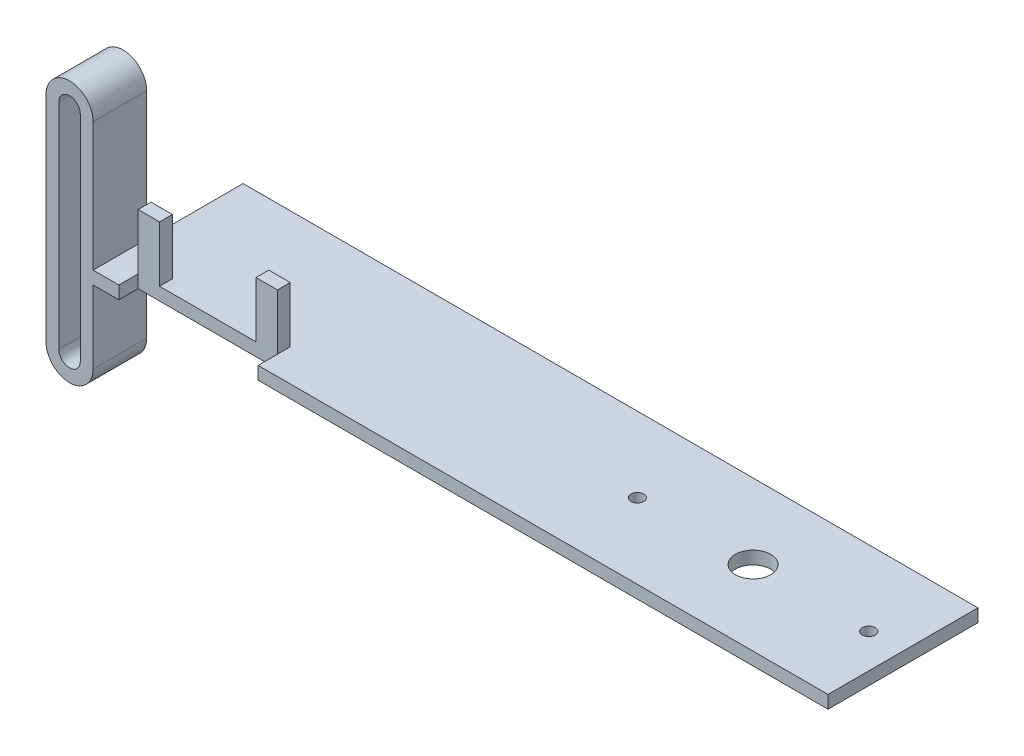
ISO-10303-21;
HEADER;
FILE_DESCRIPTION(('STEP AP214'),'2;1');
FILE_NAME('part.step','',(''),(''),'','','');
FILE_SCHEMA(('AUTOMOTIVE_DESIGN { 1 0 10303 214 1 1 1 1 }'));
ENDSEC;
DATA;
#1=APPLICATION_CONTEXT('core data for automotive mechanical design processes');
#2=APPLICATION_PROTOCOL_DEFINITION('international standard','automotive_design',2000,#1);
#3=PRODUCT_CONTEXT('',#1,'mechanical');
#4=PRODUCT('Part','Part','',(#3));
#5=PRODUCT_RELATED_PRODUCT_CATEGORY('part','',(#4));
#6=PRODUCT_DEFINITION_FORMATION('','',#4);
#7=PRODUCT_DEFINITION_CONTEXT('part definition',#1,'design');
#8=PRODUCT_DEFINITION('design','',#6,#7);
#9=PRODUCT_DEFINITION_SHAPE('','',#8);
#10=(LENGTH_UNIT() NAMED_UNIT(*) SI_UNIT(.MILLI.,.METRE.));
#11=(NAMED_UNIT(*) PLANE_ANGLE_UNIT() SI_UNIT($,.RADIAN.));
#12=(NAMED_UNIT(*) SI_UNIT($,.STERADIAN.) SOLID_ANGLE_UNIT());
#13=UNCERTAINTY_MEASURE_WITH_UNIT(LENGTH_MEASURE(1.E-05),#10,'distance_accuracy_value','');
#14=(GEOMETRIC_REPRESENTATION_CONTEXT(3) GLOBAL_UNCERTAINTY_ASSIGNED_CONTEXT((#13)) GLOBAL_UNIT_ASSIGNED_CONTEXT((#10,
#11,#12)) REPRESENTATION_CONTEXT('',''));
#15=CARTESIAN_POINT('',(0.,0.,0.));
#16=DIRECTION('',(0.,0.,1.));
#17=DIRECTION('',(1.,0.,0.));
#18=AXIS2_PLACEMENT_3D('',#15,#16,#17);
#19=CARTESIAN_POINT('',(0.,3.,0.));
#20=DIRECTION('',(0.,1.,0.));
#21=DIRECTION('',(0.,0.,1.));
#22=AXIS2_PLACEMENT_3D('',#19,#20,#21);
#23=PLANE('',#22);
#24=DIRECTION('',(0.,0.,1.));
#25=VECTOR('',#24,1.);
#26=CARTESIAN_POINT('',(-50.5000000000004,3.,5.));
#27=LINE('',#26,#25);
#28=CARTESIAN_POINT('',(-50.5000000000004,3.,5.));
#29=VERTEX_POINT('',#28);
#30=CARTESIAN_POINT('',(-50.5000000000004,3.,8.));
#31=VERTEX_POINT('',#30);
#32=EDGE_CURVE('E226',#29,#31,#27,.T.);
#33=ORIENTED_EDGE('',*,*,#32,.T.);
#34=DIRECTION('',(0.,0.,-1.));
#35=VECTOR('',#34,1.);
#36=CARTESIAN_POINT('',(-50.5000000000004,3.,0.));
#37=LINE('',#36,#35);
#38=CARTESIAN_POINT('',(-50.5000000000004,3.,12.5));
#39=VERTEX_POINT('',#38);
#40=EDGE_CURVE('E302',#39,#31,#37,.T.);
#41=ORIENTED_EDGE('',*,*,#40,.F.);
#42=DIRECTION('',(1.,0.,0.));
#43=VECTOR('',#42,1.);
#44=CARTESIAN_POINT('',(0.,3.,12.5));
#45=LINE('',#44,#43);
#46=CARTESIAN_POINT('',(82.5,3.,12.5));
#47=VERTEX_POINT('',#46);
#48=EDGE_CURVE('E426',#39,#47,#45,.T.);
#49=ORIENTED_EDGE('',*,*,#48,.T.);
#50=DIRECTION('',(0.,0.,1.));
#51=VECTOR('',#50,1.);
#52=CARTESIAN_POINT('',(82.5,3.,0.));
#53=LINE('',#52,#51);
#54=CARTESIAN_POINT('',(82.5,3.,-22.5));
#55=VERTEX_POINT('',#54);
#56=EDGE_CURVE('E425',#55,#47,#53,.T.);
#57=ORIENTED_EDGE('',*,*,#56,.F.);
#58=DIRECTION('',(1.,0.,0.));
#59=VECTOR('',#58,1.);
#60=CARTESIAN_POINT('',(0.,3.,-22.5));
#61=LINE('',#60,#59);
#62=CARTESIAN_POINT('',(-89.0000000000003,3.,-22.5));
#63=VERTEX_POINT('',#62);
#64=EDGE_CURVE('E430',#63,#55,#61,.T.);
#65=ORIENTED_EDGE('',*,*,#64,.F.);
#66=DIRECTION('',(0.,0.,1.));
#67=VECTOR('',#66,1.);
#68=CARTESIAN_POINT('',(-89.0000000000003,3.,0.));
#69=LINE('',#68,#67);
#70=CARTESIAN_POINT('',(-89.0000000000003,3.,0.));
#71=VERTEX_POINT('',#70);
#72=EDGE_CURVE('E326',#63,#71,#69,.T.);
#73=ORIENTED_EDGE('',*,*,#72,.T.);
#74=DIRECTION('',(0.,0.,-1.));
#75=VECTOR('',#74,1.);
#76=CARTESIAN_POINT('',(-89.0000000000003,3.,0.));
#77=LINE('',#76,#75);
#78=CARTESIAN_POINT('',(-89.0000000000003,3.,12.5));
#79=VERTEX_POINT('',#78);
#80=EDGE_CURVE('E353',#79,#71,#77,.T.);
#81=ORIENTED_EDGE('',*,*,#80,.F.);
#82=CARTESIAN_POINT('',(-83.0000000000004,3.,12.5));
#83=VERTEX_POINT('',#82);
#84=EDGE_CURVE('E421',#79,#83,#45,.T.);
#85=ORIENTED_EDGE('',*,*,#84,.T.);
#86=DIRECTION('',(0.,0.,-1.));
#87=VECTOR('',#86,1.);
#88=CARTESIAN_POINT('',(-83.0000000000004,3.,0.));
#89=LINE('',#88,#87);
#90=CARTESIAN_POINT('',(-83.0000000000004,3.,8.));
#91=VERTEX_POINT('',#90);
#92=EDGE_CURVE('E309',#83,#91,#89,.T.);
#93=ORIENTED_EDGE('',*,*,#92,.T.);
#94=DIRECTION('',(0.,0.,1.));
#95=VECTOR('',#94,1.);
#96=CARTESIAN_POINT('',(-83.0000000000004,3.,5.));
#97=LINE('',#96,#95);
#98=CARTESIAN_POINT('',(-83.0000000000004,3.,5.));
#99=VERTEX_POINT('',#98);
#100=EDGE_CURVE('E266',#99,#91,#97,.T.);
#101=ORIENTED_EDGE('',*,*,#100,.F.);
#102=DIRECTION('',(1.,0.,0.));
#103=VECTOR('',#102,1.);
#104=CARTESIAN_POINT('',(-83.0000000000004,3.,5.));
#105=LINE('',#104,#103);
#106=CARTESIAN_POINT('',(-78.0000000000004,3.,5.));
#107=VERTEX_POINT('',#106);
#108=EDGE_CURVE('E254',#99,#107,#105,.T.);
#109=ORIENTED_EDGE('',*,*,#108,.T.);
#110=DIRECTION('',(0.,0.,1.));
#111=VECTOR('',#110,1.);
#112=CARTESIAN_POINT('',(-78.0000000000004,3.,5.));
#113=LINE('',#112,#111);
#114=CARTESIAN_POINT('',(-78.0000000000004,3.,8.));
#115=VERTEX_POINT('',#114);
#116=EDGE_CURVE('E284',#107,#115,#113,.T.);
#117=ORIENTED_EDGE('',*,*,#116,.T.);
#118=DIRECTION('',(1.,0.,0.));
#119=VECTOR('',#118,1.);
#120=CARTESIAN_POINT('',(0.,3.,8.));
#121=LINE('',#120,#119);
#122=CARTESIAN_POINT('',(-55.5000000000004,3.,8.));
#123=VERTEX_POINT('',#122);
#124=EDGE_CURVE('E313',#115,#123,#121,.T.);
#125=ORIENTED_EDGE('',*,*,#124,.T.);
#126=DIRECTION('',(0.,0.,1.));
#127=VECTOR('',#126,1.);
#128=CARTESIAN_POINT('',(-55.5000000000004,3.,5.));
#129=LINE('',#128,#127);
#130=CARTESIAN_POINT('',(-55.5000000000004,3.,5.));
#131=VERTEX_POINT('',#130);
#132=EDGE_CURVE('E64',#131,#123,#129,.T.);
#133=ORIENTED_EDGE('',*,*,#132,.F.);
#134=DIRECTION('',(1.,0.,0.));
#135=VECTOR('',#134,1.);
#136=CARTESIAN_POINT('',(-50.5000000000004,3.,5.));
#137=LINE('',#136,#135);
#138=EDGE_CURVE('E59',#131,#29,#137,.T.);
#139=ORIENTED_EDGE('',*,*,#138,.T.);
#140=EDGE_LOOP('',(#33,#41,#49,#57,#65,#73,#81,#85,#93,#101,#109,#117,#125,#133,#139));
#141=FACE_BOUND('',#140,.T.);
#142=CARTESIAN_POINT('',(47.5,3.,-5.));
#143=DIRECTION('',(0.,1.,0.));
#144=DIRECTION('',(0.,0.,1.));
#145=AXIS2_PLACEMENT_3D('',#142,#143,#144);
#146=CIRCLE('',#145,4.125);
#147=CARTESIAN_POINT('',(47.5,3.,-0.875000000000003));
#148=VERTEX_POINT('',#147);
#149=EDGE_CURVE('E433',#148,#148,#146,.T.);
#150=ORIENTED_EDGE('',*,*,#149,.F.);
#151=EDGE_LOOP('',(#150));
#152=FACE_BOUND('',#151,.T.);
#153=CARTESIAN_POINT('',(74.5,3.,-5.));
#154=DIRECTION('',(0.,1.,0.));
#155=DIRECTION('',(0.,0.,1.));
#156=AXIS2_PLACEMENT_3D('',#153,#154,#155);
#157=CIRCLE('',#156,1.5);
#158=CARTESIAN_POINT('',(74.5,3.,-3.5));
#159=VERTEX_POINT('',#158);
#160=EDGE_CURVE('E437',#159,#159,#157,.T.);
#161=ORIENTED_EDGE('',*,*,#160,.F.);
#162=EDGE_LOOP('',(#161));
#163=FACE_BOUND('',#162,.T.);
#164=CARTESIAN_POINT('',(20.5,3.,-4.99999999999999));
#165=DIRECTION('',(0.,1.,0.));
#166=DIRECTION('',(0.,0.,1.));
#167=AXIS2_PLACEMENT_3D('',#164,#165,#166);
#168=CIRCLE('',#167,1.5);
#169=CARTESIAN_POINT('',(20.5,3.,-3.49999999999999));
#170=VERTEX_POINT('',#169);
#171=EDGE_CURVE('E441',#170,#170,#168,.F.);
#172=ORIENTED_EDGE('',*,*,#171,.T.);
#173=EDGE_LOOP('',(#172));
#174=FACE_BOUND('',#173,.T.);
#175=ADVANCED_FACE('F43',(#141,#152,#163,#174),#23,.T.);
#176=CARTESIAN_POINT('',(0.,0.,0.));
#177=DIRECTION('',(0.,1.,0.));
#178=DIRECTION('',(0.,0.,1.));
#179=AXIS2_PLACEMENT_3D('',#176,#177,#178);
#180=PLANE('',#179);
#181=CARTESIAN_POINT('',(47.5,0.,-5.));
#182=DIRECTION('',(0.,1.,0.));
#183=DIRECTION('',(0.,0.,1.));
#184=AXIS2_PLACEMENT_3D('',#181,#182,#183);
#185=CIRCLE('',#184,4.125);
#186=CARTESIAN_POINT('',(47.5,0.,-0.875000000000003));
#187=VERTEX_POINT('',#186);
#188=EDGE_CURVE('E457',#187,#187,#185,.T.);
#189=ORIENTED_EDGE('',*,*,#188,.T.);
#190=EDGE_LOOP('',(#189));
#191=FACE_BOUND('',#190,.T.);
#192=CARTESIAN_POINT('',(74.5,0.,-5.));
#193=DIRECTION('',(0.,1.,0.));
#194=DIRECTION('',(0.,0.,1.));
#195=AXIS2_PLACEMENT_3D('',#192,#193,#194);
#196=CIRCLE('',#195,1.5);
#197=CARTESIAN_POINT('',(74.5,0.,-3.5));
#198=VERTEX_POINT('',#197);
#199=EDGE_CURVE('E461',#198,#198,#196,.T.);
#200=ORIENTED_EDGE('',*,*,#199,.T.);
#201=EDGE_LOOP('',(#200));
#202=FACE_BOUND('',#201,.T.);
#203=CARTESIAN_POINT('',(20.5,0.,-4.99999999999999));
#204=DIRECTION('',(0.,1.,0.));
#205=DIRECTION('',(0.,0.,1.));
#206=AXIS2_PLACEMENT_3D('',#203,#204,#205);
#207=CIRCLE('',#206,1.5);
#208=CARTESIAN_POINT('',(20.5,0.,-3.49999999999999));
#209=VERTEX_POINT('',#208);
#210=EDGE_CURVE('E465',#209,#209,#207,.F.);
#211=ORIENTED_EDGE('',*,*,#210,.F.);
#212=EDGE_LOOP('',(#211));
#213=FACE_BOUND('',#212,.T.);
#214=DIRECTION('',(0.,0.,-1.));
#215=VECTOR('',#214,1.);
#216=CARTESIAN_POINT('',(-83.0000000000004,0.,0.));
#217=LINE('',#216,#215);
#218=CARTESIAN_POINT('',(-83.0000000000004,0.,12.5));
#219=VERTEX_POINT('',#218);
#220=CARTESIAN_POINT('',(-83.0000000000004,0.,8.));
#221=VERTEX_POINT('',#220);
#222=EDGE_CURVE('E306',#219,#221,#217,.T.);
#223=ORIENTED_EDGE('',*,*,#222,.F.);
#224=DIRECTION('',(1.,0.,0.));
#225=VECTOR('',#224,1.);
#226=CARTESIAN_POINT('',(0.,0.,12.5));
#227=LINE('',#226,#225);
#228=CARTESIAN_POINT('',(-89.0000000000002,0.,12.5));
#229=VERTEX_POINT('',#228);
#230=EDGE_CURVE('E446',#229,#219,#227,.T.);
#231=ORIENTED_EDGE('',*,*,#230,.F.);
#232=DIRECTION('',(0.,0.,-1.));
#233=VECTOR('',#232,1.);
#234=CARTESIAN_POINT('',(-89.0000000000003,0.,0.));
#235=LINE('',#234,#233);
#236=CARTESIAN_POINT('',(-89.0000000000003,0.,0.));
#237=VERTEX_POINT('',#236);
#238=EDGE_CURVE('E479',#229,#237,#235,.T.);
#239=ORIENTED_EDGE('',*,*,#238,.T.);
#240=DIRECTION('',(0.,0.,1.));
#241=VECTOR('',#240,1.);
#242=CARTESIAN_POINT('',(-89.0000000000003,0.,0.));
#243=LINE('',#242,#241);
#244=CARTESIAN_POINT('',(-89.0000000000003,0.,-22.5));
#245=VERTEX_POINT('',#244);
#246=EDGE_CURVE('E323',#245,#237,#243,.T.);
#247=ORIENTED_EDGE('',*,*,#246,.F.);
#248=DIRECTION('',(1.,0.,0.));
#249=VECTOR('',#248,1.);
#250=CARTESIAN_POINT('',(0.,0.,-22.5));
#251=LINE('',#250,#249);
#252=CARTESIAN_POINT('',(82.5,0.,-22.5));
#253=VERTEX_POINT('',#252);
#254=EDGE_CURVE('E454',#245,#253,#251,.T.);
#255=ORIENTED_EDGE('',*,*,#254,.T.);
#256=DIRECTION('',(0.,0.,1.));
#257=VECTOR('',#256,1.);
#258=CARTESIAN_POINT('',(82.5,0.,0.));
#259=LINE('',#258,#257);
#260=CARTESIAN_POINT('',(82.5,0.,12.5));
#261=VERTEX_POINT('',#260);
#262=EDGE_CURVE('E450',#253,#261,#259,.T.);
#263=ORIENTED_EDGE('',*,*,#262,.T.);
#264=CARTESIAN_POINT('',(-50.5000000000004,0.,12.5));
#265=VERTEX_POINT('',#264);
#266=EDGE_CURVE('E420',#265,#261,#227,.T.);
#267=ORIENTED_EDGE('',*,*,#266,.F.);
#268=DIRECTION('',(0.,0.,-1.));
#269=VECTOR('',#268,1.);
#270=CARTESIAN_POINT('',(-50.5000000000004,0.,0.));
#271=LINE('',#270,#269);
#272=CARTESIAN_POINT('',(-50.5000000000004,0.,8.));
#273=VERTEX_POINT('',#272);
#274=EDGE_CURVE('E298',#265,#273,#271,.T.);
#275=ORIENTED_EDGE('',*,*,#274,.T.);
#276=DIRECTION('',(1.,0.,0.));
#277=VECTOR('',#276,1.);
#278=CARTESIAN_POINT('',(0.,0.,8.));
#279=LINE('',#278,#277);
#280=EDGE_CURVE('E11',#221,#273,#279,.T.);
#281=ORIENTED_EDGE('',*,*,#280,.F.);
#282=EDGE_LOOP('',(#223,#231,#239,#247,#255,#263,#267,#275,#281));
#283=FACE_BOUND('',#282,.T.);
#284=ADVANCED_FACE('F495',(#191,#202,#213,#283),#180,.F.);
#285=CARTESIAN_POINT('',(0.,3.,12.5));
#286=DIRECTION('',(0.,0.,-1.));
#287=DIRECTION('',(-1.,0.,0.));
#288=AXIS2_PLACEMENT_3D('',#285,#286,#287);
#289=PLANE('',#288);
#290=DIRECTION('',(0.,1.,0.));
#291=VECTOR('',#290,1.);
#292=CARTESIAN_POINT('',(-97.,0.,12.5));
#293=LINE('',#292,#291);
#294=CARTESIAN_POINT('',(-97.,-17.0000000000001,12.5));
#295=VERTEX_POINT('',#294);
#296=CARTESIAN_POINT('',(-97.,33.0000000000001,12.5));
#297=VERTEX_POINT('',#296);
#298=EDGE_CURVE('E347',#295,#297,#293,.T.);
#299=ORIENTED_EDGE('',*,*,#298,.T.);
#300=CARTESIAN_POINT('',(-94.5000000000001,33.0000000000001,12.5));
#301=DIRECTION('',(0.,0.,-1.));
#302=DIRECTION('',(-1.,0.,0.));
#303=AXIS2_PLACEMENT_3D('',#300,#301,#302);
#304=CIRCLE('',#303,2.49999999999984);
#305=CARTESIAN_POINT('',(-92.0000000000003,33.0000000000001,12.5));
#306=VERTEX_POINT('',#305);
#307=EDGE_CURVE('E340',#297,#306,#304,.T.);
#308=ORIENTED_EDGE('',*,*,#307,.T.);
#309=DIRECTION('',(0.,1.,0.));
#310=VECTOR('',#309,1.);
#311=CARTESIAN_POINT('',(-92.0000000000003,0.,12.5));
#312=LINE('',#311,#310);
#313=CARTESIAN_POINT('',(-92.0000000000003,-17.0000000000001,12.5));
#314=VERTEX_POINT('',#313);
#315=EDGE_CURVE('E336',#314,#306,#312,.T.);
#316=ORIENTED_EDGE('',*,*,#315,.F.);
#317=CARTESIAN_POINT('',(-94.5000000000001,-17.0000000000001,12.5));
#318=DIRECTION('',(0.,0.,-1.));
#319=DIRECTION('',(-1.,0.,0.));
#320=AXIS2_PLACEMENT_3D('',#317,#318,#319);
#321=CIRCLE('',#320,2.49999999999984);
#322=EDGE_CURVE('E350',#314,#295,#321,.T.);
#323=ORIENTED_EDGE('',*,*,#322,.T.);
#324=EDGE_LOOP('',(#299,#308,#316,#323));
#325=FACE_BOUND('',#324,.T.);
#326=DIRECTION('',(0.,-1.,0.));
#327=VECTOR('',#326,1.);
#328=CARTESIAN_POINT('',(-83.0000000000004,3.,12.5));
#329=LINE('',#328,#327);
#330=EDGE_CURVE('E52',#83,#219,#329,.T.);
#331=ORIENTED_EDGE('',*,*,#330,.F.);
#332=ORIENTED_EDGE('',*,*,#84,.F.);
#333=DIRECTION('',(0.,1.,0.));
#334=VECTOR('',#333,1.);
#335=CARTESIAN_POINT('',(-89.0000000000003,0.,12.5));
#336=LINE('',#335,#334);
#337=CARTESIAN_POINT('',(-89.0000000000002,33.0000000000001,12.5));
#338=VERTEX_POINT('',#337);
#339=EDGE_CURVE('E335',#79,#338,#336,.T.);
#340=ORIENTED_EDGE('',*,*,#339,.T.);
#341=CARTESIAN_POINT('',(-94.5,33.0000000000001,12.5));
#342=DIRECTION('',(0.,0.,-1.));
#343=DIRECTION('',(-1.,0.,0.));
#344=AXIS2_PLACEMENT_3D('',#341,#342,#343);
#345=CIRCLE('',#344,5.49999999999981);
#346=CARTESIAN_POINT('',(-100.,33.0000000000001,12.5));
#347=VERTEX_POINT('',#346);
#348=EDGE_CURVE('E331',#347,#338,#345,.T.);
#349=ORIENTED_EDGE('',*,*,#348,.F.);
#350=DIRECTION('',(0.,-1.,0.));
#351=VECTOR('',#350,1.);
#352=CARTESIAN_POINT('',(-100.,3.,12.5));
#353=LINE('',#352,#351);
#354=CARTESIAN_POINT('',(-100.,-17.,12.5));
#355=VERTEX_POINT('',#354);
#356=EDGE_CURVE('E445',#347,#355,#353,.T.);
#357=ORIENTED_EDGE('',*,*,#356,.T.);
#358=CARTESIAN_POINT('',(-94.5000000000002,-17.,12.5));
#359=DIRECTION('',(0.,0.,-1.));
#360=DIRECTION('',(-1.,0.,0.));
#361=AXIS2_PLACEMENT_3D('',#358,#359,#360);
#362=CIRCLE('',#361,5.49999999999981);
#363=CARTESIAN_POINT('',(-89.0000000000004,-17.,12.5));
#364=VERTEX_POINT('',#363);
#365=EDGE_CURVE('E343',#364,#355,#362,.T.);
#366=ORIENTED_EDGE('',*,*,#365,.F.);
#367=EDGE_CURVE('E337',#364,#229,#336,.T.);
#368=ORIENTED_EDGE('',*,*,#367,.T.);
#369=ORIENTED_EDGE('',*,*,#230,.T.);
#370=EDGE_LOOP('',(#331,#332,#340,#349,#357,#366,#368,#369));
#371=FACE_BOUND('',#370,.T.);
#372=ADVANCED_FACE('F496',(#325,#371),#289,.F.);
#373=CARTESIAN_POINT('',(0.,3.,-22.5));
#374=DIRECTION('',(0.,0.,-1.));
#375=DIRECTION('',(-1.,0.,0.));
#376=AXIS2_PLACEMENT_3D('',#373,#374,#375);
#377=PLANE('',#376);
#378=ORIENTED_EDGE('',*,*,#254,.F.);
#379=DIRECTION('',(0.,-1.,0.));
#380=VECTOR('',#379,1.);
#381=CARTESIAN_POINT('',(-89.0000000000003,0.,-22.5));
#382=LINE('',#381,#380);
#383=EDGE_CURVE('E316',#63,#245,#382,.T.);
#384=ORIENTED_EDGE('',*,*,#383,.F.);
#385=ORIENTED_EDGE('',*,*,#64,.T.);
#386=DIRECTION('',(0.,-1.,0.));
#387=VECTOR('',#386,1.);
#388=CARTESIAN_POINT('',(82.5,3.,-22.5));
#389=LINE('',#388,#387);
#390=EDGE_CURVE('E471',#55,#253,#389,.T.);
#391=ORIENTED_EDGE('',*,*,#390,.T.);
#392=EDGE_LOOP('',(#378,#384,#385,#391));
#393=FACE_BOUND('',#392,.T.);
#394=ADVANCED_FACE('F508',(#393),#377,.T.);
#395=ORIENTED_EDGE('',*,*,#48,.F.);
#396=DIRECTION('',(0.,-1.,0.));
#397=VECTOR('',#396,1.);
#398=CARTESIAN_POINT('',(-50.5000000000004,3.,12.5));
#399=LINE('',#398,#397);
#400=EDGE_CURVE('E483',#39,#265,#399,.T.);
#401=ORIENTED_EDGE('',*,*,#400,.T.);
#402=ORIENTED_EDGE('',*,*,#266,.T.);
#403=DIRECTION('',(0.,-1.,0.));
#404=VECTOR('',#403,1.);
#405=CARTESIAN_POINT('',(82.5,3.,12.5));
#406=LINE('',#405,#404);
#407=EDGE_CURVE('E475',#47,#261,#406,.T.);
#408=ORIENTED_EDGE('',*,*,#407,.F.);
#409=EDGE_LOOP('',(#395,#401,#402,#408));
#410=FACE_BOUND('',#409,.T.);
#411=ADVANCED_FACE('F45',(#410),#289,.F.);
#412=CARTESIAN_POINT('',(82.5,3.,0.));
#413=DIRECTION('',(1.,0.,0.));
#414=DIRECTION('',(0.,0.,-1.));
#415=AXIS2_PLACEMENT_3D('',#412,#413,#414);
#416=PLANE('',#415);
#417=ORIENTED_EDGE('',*,*,#262,.F.);
#418=ORIENTED_EDGE('',*,*,#390,.F.);
#419=ORIENTED_EDGE('',*,*,#56,.T.);
#420=ORIENTED_EDGE('',*,*,#407,.T.);
#421=EDGE_LOOP('',(#417,#418,#419,#420));
#422=FACE_BOUND('',#421,.T.);
#423=ADVANCED_FACE('F514',(#422),#416,.T.);
#424=CARTESIAN_POINT('',(74.5,3.,-5.));
#425=DIRECTION('',(0.,-1.,0.));
#426=DIRECTION('',(0.,0.,-1.));
#427=AXIS2_PLACEMENT_3D('',#424,#425,#426);
#428=CYLINDRICAL_SURFACE('',#427,1.5);
#429=ORIENTED_EDGE('',*,*,#160,.T.);
#430=EDGE_LOOP('',(#429));
#431=FACE_BOUND('',#430,.T.);
#432=ORIENTED_EDGE('',*,*,#199,.F.);
#433=EDGE_LOOP('',(#432));
#434=FACE_BOUND('',#433,.T.);
#435=ADVANCED_FACE('F570',(#431,#434),#428,.F.);
#436=CARTESIAN_POINT('',(47.5,3.,-5.));
#437=DIRECTION('',(0.,-1.,0.));
#438=DIRECTION('',(0.,0.,-1.));
#439=AXIS2_PLACEMENT_3D('',#436,#437,#438);
#440=CYLINDRICAL_SURFACE('',#439,4.125);
#441=ORIENTED_EDGE('',*,*,#149,.T.);
#442=EDGE_LOOP('',(#441));
#443=FACE_BOUND('',#442,.T.);
#444=ORIENTED_EDGE('',*,*,#188,.F.);
#445=EDGE_LOOP('',(#444));
#446=FACE_BOUND('',#445,.T.);
#447=ADVANCED_FACE('F573',(#443,#446),#440,.F.);
#448=CARTESIAN_POINT('',(-100.,3.,0.));
#449=DIRECTION('',(1.,0.,0.));
#450=DIRECTION('',(0.,0.,-1.));
#451=AXIS2_PLACEMENT_3D('',#448,#449,#450);
#452=PLANE('',#451);
#453=DIRECTION('',(0.,0.,-1.));
#454=VECTOR('',#453,1.);
#455=CARTESIAN_POINT('',(-100.,33.0000000000001,74.4838688692467));
#456=LINE('',#455,#454);
#457=CARTESIAN_POINT('',(-100.,33.0000000000001,0.));
#458=VERTEX_POINT('',#457);
#459=EDGE_CURVE('E393',#347,#458,#456,.T.);
#460=ORIENTED_EDGE('',*,*,#459,.T.);
#461=DIRECTION('',(0.,-1.,0.));
#462=VECTOR('',#461,1.);
#463=CARTESIAN_POINT('',(-100.,0.,0.));
#464=LINE('',#463,#462);
#465=CARTESIAN_POINT('',(-100.,-17.,0.));
#466=VERTEX_POINT('',#465);
#467=EDGE_CURVE('E376',#458,#466,#464,.T.);
#468=ORIENTED_EDGE('',*,*,#467,.T.);
#469=DIRECTION('',(0.,0.,-1.));
#470=VECTOR('',#469,1.);
#471=CARTESIAN_POINT('',(-100.,-17.,74.4838688692467));
#472=LINE('',#471,#470);
#473=EDGE_CURVE('E388',#355,#466,#472,.T.);
#474=ORIENTED_EDGE('',*,*,#473,.F.);
#475=ORIENTED_EDGE('',*,*,#356,.F.);
#476=EDGE_LOOP('',(#460,#468,#474,#475));
#477=FACE_BOUND('',#476,.T.);
#478=ADVANCED_FACE('F529',(#477),#452,.F.);
#479=CARTESIAN_POINT('',(20.5,3.,-4.99999999999999));
#480=DIRECTION('',(0.,-1.,0.));
#481=DIRECTION('',(0.,0.,-1.));
#482=AXIS2_PLACEMENT_3D('',#479,#480,#481);
#483=CYLINDRICAL_SURFACE('',#482,1.5);
#484=ORIENTED_EDGE('',*,*,#171,.F.);
#485=EDGE_LOOP('',(#484));
#486=FACE_BOUND('',#485,.T.);
#487=ORIENTED_EDGE('',*,*,#210,.T.);
#488=EDGE_LOOP('',(#487));
#489=FACE_BOUND('',#488,.T.);
#490=ADVANCED_FACE('F566',(#486,#489),#483,.F.);
#491=CARTESIAN_POINT('',(-94.5000000000002,-17.,74.4838688692467));
#492=DIRECTION('',(0.,0.,-1.));
#493=DIRECTION('',(-1.,0.,0.));
#494=AXIS2_PLACEMENT_3D('',#491,#492,#493);
#495=CYLINDRICAL_SURFACE('',#494,5.49999999999981);
#496=DIRECTION('',(0.,0.,-1.));
#497=VECTOR('',#496,1.);
#498=CARTESIAN_POINT('',(-89.0000000000003,-17.,74.4838688692467));
#499=LINE('',#498,#497);
#500=CARTESIAN_POINT('',(-89.0000000000003,-17.,0.));
#501=VERTEX_POINT('',#500);
#502=EDGE_CURVE('E384',#364,#501,#499,.T.);
#503=ORIENTED_EDGE('',*,*,#502,.F.);
#504=ORIENTED_EDGE('',*,*,#365,.T.);
#505=ORIENTED_EDGE('',*,*,#473,.T.);
#506=CARTESIAN_POINT('',(-94.5000000000002,-17.,0.));
#507=DIRECTION('',(0.,0.,1.));
#508=DIRECTION('',(1.,0.,0.));
#509=AXIS2_PLACEMENT_3D('',#506,#507,#508);
#510=CIRCLE('',#509,5.49999999999981);
#511=EDGE_CURVE('E379',#466,#501,#510,.T.);
#512=ORIENTED_EDGE('',*,*,#511,.T.);
#513=EDGE_LOOP('',(#503,#504,#505,#512));
#514=FACE_BOUND('',#513,.T.);
#515=ADVANCED_FACE('F526',(#514),#495,.T.);
#516=CARTESIAN_POINT('',(-94.5000000000001,-17.0000000000001,74.4838688692467));
#517=DIRECTION('',(0.,0.,-1.));
#518=DIRECTION('',(-1.,0.,0.));
#519=AXIS2_PLACEMENT_3D('',#516,#517,#518);
#520=CYLINDRICAL_SURFACE('',#519,2.49999999999984);
#521=ORIENTED_EDGE('',*,*,#322,.F.);
#522=DIRECTION('',(0.,0.,-1.));
#523=VECTOR('',#522,1.);
#524=CARTESIAN_POINT('',(-92.0000000000003,-17.0000000000001,74.4838688692467));
#525=LINE('',#524,#523);
#526=CARTESIAN_POINT('',(-92.0000000000003,-17.0000000000001,0.));
#527=VERTEX_POINT('',#526);
#528=EDGE_CURVE('E383',#314,#527,#525,.T.);
#529=ORIENTED_EDGE('',*,*,#528,.T.);
#530=CARTESIAN_POINT('',(-94.5000000000001,-17.0000000000001,0.));
#531=DIRECTION('',(0.,0.,1.));
#532=DIRECTION('',(1.,0.,0.));
#533=AXIS2_PLACEMENT_3D('',#530,#531,#532);
#534=CIRCLE('',#533,2.49999999999984);
#535=CARTESIAN_POINT('',(-97.,-17.0000000000001,0.));
#536=VERTEX_POINT('',#535);
#537=EDGE_CURVE('E330',#536,#527,#534,.T.);
#538=ORIENTED_EDGE('',*,*,#537,.F.);
#539=DIRECTION('',(0.,0.,-1.));
#540=VECTOR('',#539,1.);
#541=CARTESIAN_POINT('',(-97.,-17.0000000000001,74.4838688692467));
#542=LINE('',#541,#540);
#543=EDGE_CURVE('E389',#295,#536,#542,.T.);
#544=ORIENTED_EDGE('',*,*,#543,.F.);
#545=EDGE_LOOP('',(#521,#529,#538,#544));
#546=FACE_BOUND('',#545,.T.);
#547=ADVANCED_FACE('F563',(#546),#520,.F.);
#548=CARTESIAN_POINT('',(-89.0000000000003,0.,74.4838688692467));
#549=DIRECTION('',(1.,0.,0.));
#550=DIRECTION('',(0.,1.,0.));
#551=AXIS2_PLACEMENT_3D('',#548,#549,#550);
#552=PLANE('',#551);
#553=ORIENTED_EDGE('',*,*,#238,.F.);
#554=ORIENTED_EDGE('',*,*,#367,.F.);
#555=ORIENTED_EDGE('',*,*,#502,.T.);
#556=DIRECTION('',(0.,-1.,0.));
#557=VECTOR('',#556,1.);
#558=CARTESIAN_POINT('',(-89.0000000000003,0.,0.));
#559=LINE('',#558,#557);
#560=EDGE_CURVE('E367',#237,#501,#559,.T.);
#561=ORIENTED_EDGE('',*,*,#560,.F.);
#562=EDGE_LOOP('',(#553,#554,#555,#561));
#563=FACE_BOUND('',#562,.T.);
#564=ADVANCED_FACE('F502',(#563),#552,.T.);
#565=CARTESIAN_POINT('',(0.,0.,0.));
#566=DIRECTION('',(0.,0.,1.));
#567=DIRECTION('',(1.,0.,0.));
#568=AXIS2_PLACEMENT_3D('',#565,#566,#567);
#569=PLANE('',#568);
#570=CARTESIAN_POINT('',(-89.0000000000004,33.0000000000001,0.));
#571=VERTEX_POINT('',#570);
#572=EDGE_CURVE('E368',#571,#71,#559,.T.);
#573=ORIENTED_EDGE('',*,*,#572,.T.);
#574=DIRECTION('',(0.,-1.,0.));
#575=VECTOR('',#574,1.);
#576=CARTESIAN_POINT('',(-89.0000000000003,0.,0.));
#577=LINE('',#576,#575);
#578=EDGE_CURVE('E319',#71,#237,#577,.T.);
#579=ORIENTED_EDGE('',*,*,#578,.T.);
#580=ORIENTED_EDGE('',*,*,#560,.T.);
#581=ORIENTED_EDGE('',*,*,#511,.F.);
#582=ORIENTED_EDGE('',*,*,#467,.F.);
#583=CARTESIAN_POINT('',(-94.5,33.0000000000001,0.));
#584=DIRECTION('',(0.,0.,1.));
#585=DIRECTION('',(1.,0.,0.));
#586=AXIS2_PLACEMENT_3D('',#583,#584,#585);
#587=CIRCLE('',#586,5.49999999999981);
#588=EDGE_CURVE('E372',#571,#458,#587,.T.);
#589=ORIENTED_EDGE('',*,*,#588,.F.);
#590=EDGE_LOOP('',(#573,#579,#580,#581,#582,#589));
#591=FACE_BOUND('',#590,.T.);
#592=DIRECTION('',(0.,-1.,0.));
#593=VECTOR('',#592,1.);
#594=CARTESIAN_POINT('',(-92.0000000000003,0.,0.));
#595=LINE('',#594,#593);
#596=CARTESIAN_POINT('',(-92.0000000000003,33.0000000000001,0.));
#597=VERTEX_POINT('',#596);
#598=EDGE_CURVE('E364',#597,#527,#595,.T.);
#599=ORIENTED_EDGE('',*,*,#598,.F.);
#600=CARTESIAN_POINT('',(-94.5000000000001,33.0000000000001,0.));
#601=DIRECTION('',(0.,0.,1.));
#602=DIRECTION('',(1.,0.,0.));
#603=AXIS2_PLACEMENT_3D('',#600,#601,#602);
#604=CIRCLE('',#603,2.49999999999984);
#605=CARTESIAN_POINT('',(-97.,33.0000000000001,0.));
#606=VERTEX_POINT('',#605);
#607=EDGE_CURVE('E360',#597,#606,#604,.T.);
#608=ORIENTED_EDGE('',*,*,#607,.T.);
#609=DIRECTION('',(0.,-1.,0.));
#610=VECTOR('',#609,1.);
#611=CARTESIAN_POINT('',(-97.,0.,0.));
#612=LINE('',#611,#610);
#613=EDGE_CURVE('E357',#606,#536,#612,.T.);
#614=ORIENTED_EDGE('',*,*,#613,.T.);
#615=ORIENTED_EDGE('',*,*,#537,.T.);
#616=EDGE_LOOP('',(#599,#608,#614,#615));
#617=FACE_BOUND('',#616,.T.);
#618=ADVANCED_FACE('F523',(#591,#617),#569,.F.);
#619=CARTESIAN_POINT('',(-97.,0.,74.4838688692467));
#620=DIRECTION('',(1.,0.,0.));
#621=DIRECTION('',(0.,0.,-1.));
#622=AXIS2_PLACEMENT_3D('',#619,#620,#621);
#623=PLANE('',#622);
#624=ORIENTED_EDGE('',*,*,#613,.F.);
#625=DIRECTION('',(0.,0.,-1.));
#626=VECTOR('',#625,1.);
#627=CARTESIAN_POINT('',(-97.,33.0000000000001,74.4838688692467));
#628=LINE('',#627,#626);
#629=EDGE_CURVE('E407',#297,#606,#628,.T.);
#630=ORIENTED_EDGE('',*,*,#629,.F.);
#631=ORIENTED_EDGE('',*,*,#298,.F.);
#632=ORIENTED_EDGE('',*,*,#543,.T.);
#633=EDGE_LOOP('',(#624,#630,#631,#632));
#634=FACE_BOUND('',#633,.T.);
#635=ADVANCED_FACE('F599',(#634),#623,.T.);
#636=CARTESIAN_POINT('',(-92.0000000000003,0.,74.4838688692467));
#637=DIRECTION('',(1.,0.,0.));
#638=DIRECTION('',(0.,1.,0.));
#639=AXIS2_PLACEMENT_3D('',#636,#637,#638);
#640=PLANE('',#639);
#641=DIRECTION('',(0.,0.,-1.));
#642=VECTOR('',#641,1.);
#643=CARTESIAN_POINT('',(-92.0000000000003,33.0000000000001,74.4838688692467));
#644=LINE('',#643,#642);
#645=EDGE_CURVE('E403',#306,#597,#644,.T.);
#646=ORIENTED_EDGE('',*,*,#645,.T.);
#647=ORIENTED_EDGE('',*,*,#598,.T.);
#648=ORIENTED_EDGE('',*,*,#528,.F.);
#649=ORIENTED_EDGE('',*,*,#315,.T.);
#650=EDGE_LOOP('',(#646,#647,#648,#649));
#651=FACE_BOUND('',#650,.T.);
#652=ADVANCED_FACE('F604',(#651),#640,.F.);
#653=CARTESIAN_POINT('',(-94.5000000000001,33.0000000000001,74.4838688692467));
#654=DIRECTION('',(0.,0.,-1.));
#655=DIRECTION('',(-1.,0.,0.));
#656=AXIS2_PLACEMENT_3D('',#653,#654,#655);
#657=CYLINDRICAL_SURFACE('',#656,2.49999999999984);
#658=ORIENTED_EDGE('',*,*,#307,.F.);
#659=ORIENTED_EDGE('',*,*,#629,.T.);
#660=ORIENTED_EDGE('',*,*,#607,.F.);
#661=ORIENTED_EDGE('',*,*,#645,.F.);
#662=EDGE_LOOP('',(#658,#659,#660,#661));
#663=FACE_BOUND('',#662,.T.);
#664=ADVANCED_FACE('F602',(#663),#657,.F.);
#665=CARTESIAN_POINT('',(-94.5,33.0000000000001,74.4838688692467));
#666=DIRECTION('',(0.,0.,-1.));
#667=DIRECTION('',(-1.,0.,0.));
#668=AXIS2_PLACEMENT_3D('',#665,#666,#667);
#669=CYLINDRICAL_SURFACE('',#668,5.49999999999981);
#670=ORIENTED_EDGE('',*,*,#459,.F.);
#671=ORIENTED_EDGE('',*,*,#348,.T.);
#672=DIRECTION('',(0.,0.,-1.));
#673=VECTOR('',#672,1.);
#674=CARTESIAN_POINT('',(-89.0000000000004,33.0000000000001,74.4838688692467));
#675=LINE('',#674,#673);
#676=EDGE_CURVE('E397',#338,#571,#675,.T.);
#677=ORIENTED_EDGE('',*,*,#676,.T.);
#678=ORIENTED_EDGE('',*,*,#588,.T.);
#679=EDGE_LOOP('',(#670,#671,#677,#678));
#680=FACE_BOUND('',#679,.T.);
#681=ADVANCED_FACE('F551',(#680),#669,.T.);
#682=ORIENTED_EDGE('',*,*,#339,.F.);
#683=ORIENTED_EDGE('',*,*,#80,.T.);
#684=ORIENTED_EDGE('',*,*,#572,.F.);
#685=ORIENTED_EDGE('',*,*,#676,.F.);
#686=EDGE_LOOP('',(#682,#683,#684,#685));
#687=FACE_BOUND('',#686,.T.);
#688=ADVANCED_FACE('F538',(#687),#552,.T.);
#689=CARTESIAN_POINT('',(-89.0000000000003,0.,-84.4838688692467));
#690=DIRECTION('',(-1.,0.,0.));
#691=DIRECTION('',(0.,-1.,0.));
#692=AXIS2_PLACEMENT_3D('',#689,#690,#691);
#693=PLANE('',#692);
#694=ORIENTED_EDGE('',*,*,#383,.T.);
#695=ORIENTED_EDGE('',*,*,#246,.T.);
#696=ORIENTED_EDGE('',*,*,#578,.F.);
#697=ORIENTED_EDGE('',*,*,#72,.F.);
#698=EDGE_LOOP('',(#694,#695,#696,#697));
#699=FACE_BOUND('',#698,.T.);
#700=ADVANCED_FACE('F541',(#699),#693,.T.);
#701=CARTESIAN_POINT('',(0.,0.,8.));
#702=DIRECTION('',(0.,0.,1.));
#703=DIRECTION('',(1.,0.,0.));
#704=AXIS2_PLACEMENT_3D('',#701,#702,#703);
#705=PLANE('',#704);
#706=DIRECTION('',(0.,-1.,0.));
#707=VECTOR('',#706,1.);
#708=CARTESIAN_POINT('',(-83.0000000000004,0.,8.));
#709=LINE('',#708,#707);
#710=EDGE_CURVE('E294',#91,#221,#709,.T.);
#711=ORIENTED_EDGE('',*,*,#710,.T.);
#712=ORIENTED_EDGE('',*,*,#280,.T.);
#713=DIRECTION('',(0.,-1.,0.));
#714=VECTOR('',#713,1.);
#715=CARTESIAN_POINT('',(-50.5000000000004,0.,8.));
#716=LINE('',#715,#714);
#717=EDGE_CURVE('E280',#31,#273,#716,.T.);
#718=ORIENTED_EDGE('',*,*,#717,.F.);
#719=DIRECTION('',(0.,1.,0.));
#720=VECTOR('',#719,1.);
#721=CARTESIAN_POINT('',(-50.5000000000004,3.,8.));
#722=LINE('',#721,#720);
#723=CARTESIAN_POINT('',(-50.5000000000004,16.,8.));
#724=VERTEX_POINT('',#723);
#725=EDGE_CURVE('E238',#31,#724,#722,.T.);
#726=ORIENTED_EDGE('',*,*,#725,.T.);
#727=DIRECTION('',(-1.,0.,0.));
#728=VECTOR('',#727,1.);
#729=CARTESIAN_POINT('',(-50.5000000000004,16.,8.));
#730=LINE('',#729,#728);
#731=CARTESIAN_POINT('',(-55.5000000000004,16.,8.));
#732=VERTEX_POINT('',#731);
#733=EDGE_CURVE('E209',#724,#732,#730,.T.);
#734=ORIENTED_EDGE('',*,*,#733,.T.);
#735=DIRECTION('',(0.,-1.,0.));
#736=VECTOR('',#735,1.);
#737=CARTESIAN_POINT('',(-55.5000000000004,3.,8.));
#738=LINE('',#737,#736);
#739=EDGE_CURVE('E228',#732,#123,#738,.T.);
#740=ORIENTED_EDGE('',*,*,#739,.T.);
#741=ORIENTED_EDGE('',*,*,#124,.F.);
#742=DIRECTION('',(0.,1.,0.));
#743=VECTOR('',#742,1.);
#744=CARTESIAN_POINT('',(-78.0000000000004,3.,8.));
#745=LINE('',#744,#743);
#746=CARTESIAN_POINT('',(-78.0000000000004,16.,8.));
#747=VERTEX_POINT('',#746);
#748=EDGE_CURVE('E270',#115,#747,#745,.T.);
#749=ORIENTED_EDGE('',*,*,#748,.T.);
#750=DIRECTION('',(-1.,0.,0.));
#751=VECTOR('',#750,1.);
#752=CARTESIAN_POINT('',(-83.0000000000004,16.,8.));
#753=LINE('',#752,#751);
#754=CARTESIAN_POINT('',(-83.0000000000004,16.,8.));
#755=VERTEX_POINT('',#754);
#756=EDGE_CURVE('E255',#747,#755,#753,.T.);
#757=ORIENTED_EDGE('',*,*,#756,.T.);
#758=DIRECTION('',(0.,-1.,0.));
#759=VECTOR('',#758,1.);
#760=CARTESIAN_POINT('',(-83.0000000000004,3.,8.));
#761=LINE('',#760,#759);
#762=EDGE_CURVE('E245',#755,#91,#761,.T.);
#763=ORIENTED_EDGE('',*,*,#762,.T.);
#764=EDGE_LOOP('',(#711,#712,#718,#726,#734,#740,#741,#749,#757,#763));
#765=FACE_BOUND('',#764,.T.);
#766=ADVANCED_FACE('F543',(#765),#705,.T.);
#767=CARTESIAN_POINT('',(-83.0000000000004,0.,46.4737806416799));
#768=DIRECTION('',(1.,0.,0.));
#769=DIRECTION('',(0.,0.,-1.));
#770=AXIS2_PLACEMENT_3D('',#767,#768,#769);
#771=PLANE('',#770);
#772=ORIENTED_EDGE('',*,*,#330,.T.);
#773=ORIENTED_EDGE('',*,*,#222,.T.);
#774=ORIENTED_EDGE('',*,*,#710,.F.);
#775=ORIENTED_EDGE('',*,*,#92,.F.);
#776=EDGE_LOOP('',(#772,#773,#774,#775));
#777=FACE_BOUND('',#776,.T.);
#778=ADVANCED_FACE('F490',(#777),#771,.T.);
#779=CARTESIAN_POINT('',(-50.5000000000004,0.,46.4737806416799));
#780=DIRECTION('',(1.,0.,0.));
#781=DIRECTION('',(0.,0.,-1.));
#782=AXIS2_PLACEMENT_3D('',#779,#780,#781);
#783=PLANE('',#782);
#784=ORIENTED_EDGE('',*,*,#40,.T.);
#785=ORIENTED_EDGE('',*,*,#717,.T.);
#786=ORIENTED_EDGE('',*,*,#274,.F.);
#787=ORIENTED_EDGE('',*,*,#400,.F.);
#788=EDGE_LOOP('',(#784,#785,#786,#787));
#789=FACE_BOUND('',#788,.T.);
#790=ADVANCED_FACE('F670',(#789),#783,.F.);
#791=CARTESIAN_POINT('',(-83.0000000000004,3.,5.));
#792=DIRECTION('',(-1.,0.,0.));
#793=DIRECTION('',(0.,0.,1.));
#794=AXIS2_PLACEMENT_3D('',#791,#792,#793);
#795=PLANE('',#794);
#796=ORIENTED_EDGE('',*,*,#762,.F.);
#797=DIRECTION('',(0.,0.,1.));
#798=VECTOR('',#797,1.);
#799=CARTESIAN_POINT('',(-83.0000000000004,16.,5.));
#800=LINE('',#799,#798);
#801=CARTESIAN_POINT('',(-83.0000000000004,16.,5.));
#802=VERTEX_POINT('',#801);
#803=EDGE_CURVE('E277',#802,#755,#800,.T.);
#804=ORIENTED_EDGE('',*,*,#803,.F.);
#805=DIRECTION('',(0.,-1.,0.));
#806=VECTOR('',#805,1.);
#807=CARTESIAN_POINT('',(-83.0000000000004,3.,5.));
#808=LINE('',#807,#806);
#809=EDGE_CURVE('E250',#802,#99,#808,.T.);
#810=ORIENTED_EDGE('',*,*,#809,.T.);
#811=ORIENTED_EDGE('',*,*,#100,.T.);
#812=EDGE_LOOP('',(#796,#804,#810,#811));
#813=FACE_BOUND('',#812,.T.);
#814=ADVANCED_FACE('F674',(#813),#795,.T.);
#815=CARTESIAN_POINT('',(-83.0000000000004,16.,5.));
#816=DIRECTION('',(0.,1.,0.));
#817=DIRECTION('',(0.,0.,1.));
#818=AXIS2_PLACEMENT_3D('',#815,#816,#817);
#819=PLANE('',#818);
#820=ORIENTED_EDGE('',*,*,#756,.F.);
#821=DIRECTION('',(0.,0.,1.));
#822=VECTOR('',#821,1.);
#823=CARTESIAN_POINT('',(-78.0000000000004,16.,5.));
#824=LINE('',#823,#822);
#825=CARTESIAN_POINT('',(-78.0000000000004,16.,5.));
#826=VERTEX_POINT('',#825);
#827=EDGE_CURVE('E281',#826,#747,#824,.T.);
#828=ORIENTED_EDGE('',*,*,#827,.F.);
#829=DIRECTION('',(-1.,0.,0.));
#830=VECTOR('',#829,1.);
#831=CARTESIAN_POINT('',(-83.0000000000004,16.,5.));
#832=LINE('',#831,#830);
#833=EDGE_CURVE('E262',#826,#802,#832,.T.);
#834=ORIENTED_EDGE('',*,*,#833,.T.);
#835=ORIENTED_EDGE('',*,*,#803,.T.);
#836=EDGE_LOOP('',(#820,#828,#834,#835));
#837=FACE_BOUND('',#836,.T.);
#838=ADVANCED_FACE('F705',(#837),#819,.T.);
#839=CARTESIAN_POINT('',(-78.0000000000004,3.,5.));
#840=DIRECTION('',(1.,0.,0.));
#841=DIRECTION('',(0.,0.,-1.));
#842=AXIS2_PLACEMENT_3D('',#839,#840,#841);
#843=PLANE('',#842);
#844=ORIENTED_EDGE('',*,*,#748,.F.);
#845=ORIENTED_EDGE('',*,*,#116,.F.);
#846=DIRECTION('',(0.,1.,0.));
#847=VECTOR('',#846,1.);
#848=CARTESIAN_POINT('',(-78.0000000000004,3.,5.));
#849=LINE('',#848,#847);
#850=EDGE_CURVE('E258',#107,#826,#849,.T.);
#851=ORIENTED_EDGE('',*,*,#850,.T.);
#852=ORIENTED_EDGE('',*,*,#827,.T.);
#853=EDGE_LOOP('',(#844,#845,#851,#852));
#854=FACE_BOUND('',#853,.T.);
#855=ADVANCED_FACE('F715',(#854),#843,.T.);
#856=CARTESIAN_POINT('',(0.,0.,5.));
#857=DIRECTION('',(0.,0.,-1.));
#858=DIRECTION('',(-1.,0.,0.));
#859=AXIS2_PLACEMENT_3D('',#856,#857,#858);
#860=PLANE('',#859);
#861=ORIENTED_EDGE('',*,*,#809,.F.);
#862=ORIENTED_EDGE('',*,*,#833,.F.);
#863=ORIENTED_EDGE('',*,*,#850,.F.);
#864=ORIENTED_EDGE('',*,*,#108,.F.);
#865=EDGE_LOOP('',(#861,#862,#863,#864));
#866=FACE_BOUND('',#865,.T.);
#867=ADVANCED_FACE('F725',(#866),#860,.T.);
#868=CARTESIAN_POINT('',(-50.5000000000004,3.,5.));
#869=DIRECTION('',(1.,0.,0.));
#870=DIRECTION('',(0.,0.,-1.));
#871=AXIS2_PLACEMENT_3D('',#868,#869,#870);
#872=PLANE('',#871);
#873=ORIENTED_EDGE('',*,*,#725,.F.);
#874=ORIENTED_EDGE('',*,*,#32,.F.);
#875=DIRECTION('',(0.,1.,0.));
#876=VECTOR('',#875,1.);
#877=CARTESIAN_POINT('',(-50.5000000000004,3.,5.));
#878=LINE('',#877,#876);
#879=CARTESIAN_POINT('',(-50.5000000000004,16.,5.));
#880=VERTEX_POINT('',#879);
#881=EDGE_CURVE('E221',#29,#880,#878,.T.);
#882=ORIENTED_EDGE('',*,*,#881,.T.);
#883=DIRECTION('',(0.,0.,1.));
#884=VECTOR('',#883,1.);
#885=CARTESIAN_POINT('',(-50.5000000000004,16.,5.));
#886=LINE('',#885,#884);
#887=EDGE_CURVE('E204',#880,#724,#886,.T.);
#888=ORIENTED_EDGE('',*,*,#887,.T.);
#889=EDGE_LOOP('',(#873,#874,#882,#888));
#890=FACE_BOUND('',#889,.T.);
#891=ADVANCED_FACE('F225',(#890),#872,.T.);
#892=CARTESIAN_POINT('',(-55.5000000000004,3.,5.));
#893=DIRECTION('',(-1.,0.,0.));
#894=DIRECTION('',(0.,0.,1.));
#895=AXIS2_PLACEMENT_3D('',#892,#893,#894);
#896=PLANE('',#895);
#897=ORIENTED_EDGE('',*,*,#739,.F.);
#898=DIRECTION('',(0.,0.,1.));
#899=VECTOR('',#898,1.);
#900=CARTESIAN_POINT('',(-55.5000000000004,16.,5.));
#901=LINE('',#900,#899);
#902=CARTESIAN_POINT('',(-55.5000000000004,16.,5.));
#903=VERTEX_POINT('',#902);
#904=EDGE_CURVE('E215',#903,#732,#901,.T.);
#905=ORIENTED_EDGE('',*,*,#904,.F.);
#906=DIRECTION('',(0.,-1.,0.));
#907=VECTOR('',#906,1.);
#908=CARTESIAN_POINT('',(-55.5000000000004,3.,5.));
#909=LINE('',#908,#907);
#910=EDGE_CURVE('E222',#903,#131,#909,.T.);
#911=ORIENTED_EDGE('',*,*,#910,.T.);
#912=ORIENTED_EDGE('',*,*,#132,.T.);
#913=EDGE_LOOP('',(#897,#905,#911,#912));
#914=FACE_BOUND('',#913,.T.);
#915=ADVANCED_FACE('F744',(#914),#896,.T.);
#916=CARTESIAN_POINT('',(-50.5000000000004,16.,5.));
#917=DIRECTION('',(0.,1.,0.));
#918=DIRECTION('',(0.,0.,1.));
#919=AXIS2_PLACEMENT_3D('',#916,#917,#918);
#920=PLANE('',#919);
#921=ORIENTED_EDGE('',*,*,#733,.F.);
#922=ORIENTED_EDGE('',*,*,#887,.F.);
#923=DIRECTION('',(-1.,0.,0.));
#924=VECTOR('',#923,1.);
#925=CARTESIAN_POINT('',(-50.5000000000004,16.,5.));
#926=LINE('',#925,#924);
#927=EDGE_CURVE('E207',#880,#903,#926,.T.);
#928=ORIENTED_EDGE('',*,*,#927,.T.);
#929=ORIENTED_EDGE('',*,*,#904,.T.);
#930=EDGE_LOOP('',(#921,#922,#928,#929));
#931=FACE_BOUND('',#930,.T.);
#932=ADVANCED_FACE('F206',(#931),#920,.T.);
#933=CARTESIAN_POINT('',(0.,0.,5.));
#934=DIRECTION('',(0.,0.,1.));
#935=DIRECTION('',(1.,0.,0.));
#936=AXIS2_PLACEMENT_3D('',#933,#934,#935);
#937=PLANE('',#936);
#938=ORIENTED_EDGE('',*,*,#881,.F.);
#939=ORIENTED_EDGE('',*,*,#138,.F.);
#940=ORIENTED_EDGE('',*,*,#910,.F.);
#941=ORIENTED_EDGE('',*,*,#927,.F.);
#942=EDGE_LOOP('',(#938,#939,#940,#941));
#943=FACE_BOUND('',#942,.T.);
#944=ADVANCED_FACE('F220',(#943),#937,.F.);
#945=CLOSED_SHELL('',(#175,#284,#372,#394,#411,#423,#435,#447,#478,#490,#515,#547,#564,#618,
#635,#652,#664,#681,#688,#700,#766,#778,#790,#814,#838,#855,#867,#891,#915,#932,#944));
#946=MANIFOLD_SOLID_BREP('B2',#945);
#947=ADVANCED_BREP_SHAPE_REPRESENTATION('',(#18,#946),#14);
#948=SHAPE_DEFINITION_REPRESENTATION(#9,#947);
ENDSEC;
END-ISO-10303-21;
